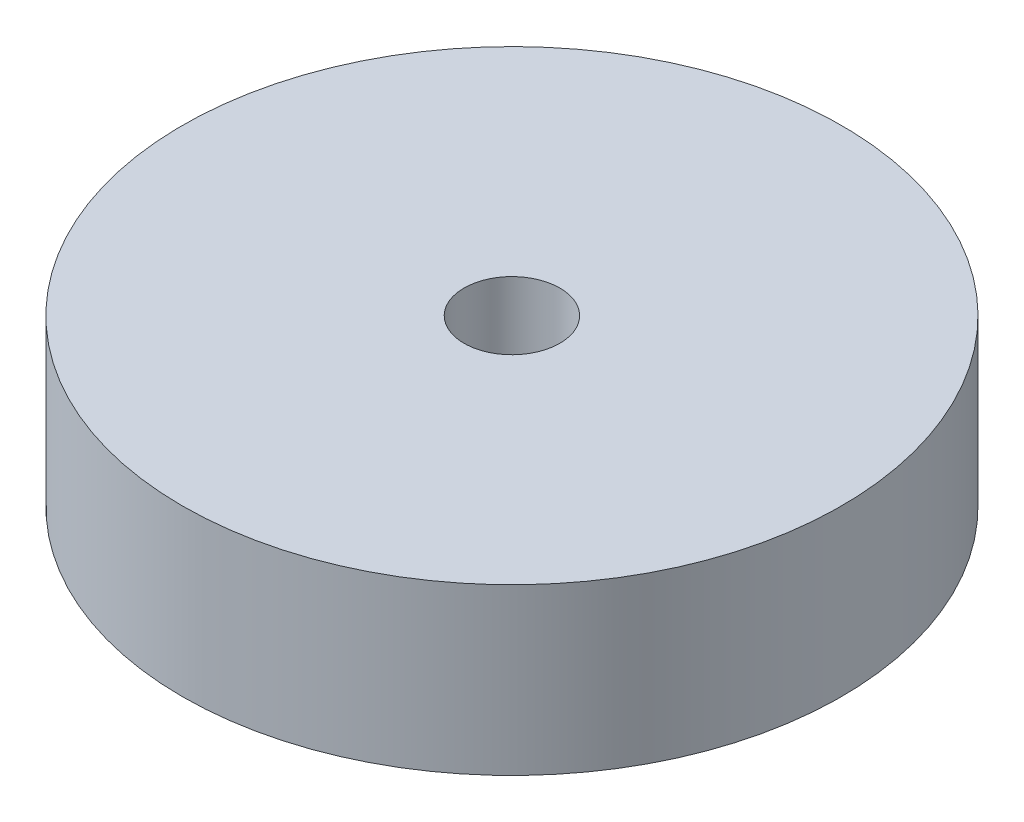
ISO-10303-21;
HEADER;
FILE_DESCRIPTION(('STEP AP214'),'2;1');
FILE_NAME('part.step','',(''),(''),'','','');
FILE_SCHEMA(('AUTOMOTIVE_DESIGN { 1 0 10303 214 1 1 1 1 }'));
ENDSEC;
DATA;
#1=APPLICATION_CONTEXT('core data for automotive mechanical design processes');
#2=APPLICATION_PROTOCOL_DEFINITION('international standard','automotive_design',2000,#1);
#3=PRODUCT_CONTEXT('',#1,'mechanical');
#4=PRODUCT('Part','Part','',(#3));
#5=PRODUCT_RELATED_PRODUCT_CATEGORY('part','',(#4));
#6=PRODUCT_DEFINITION_FORMATION('','',#4);
#7=PRODUCT_DEFINITION_CONTEXT('part definition',#1,'design');
#8=PRODUCT_DEFINITION('design','',#6,#7);
#9=PRODUCT_DEFINITION_SHAPE('','',#8);
#10=(LENGTH_UNIT() NAMED_UNIT(*) SI_UNIT(.MILLI.,.METRE.));
#11=(NAMED_UNIT(*) PLANE_ANGLE_UNIT() SI_UNIT($,.RADIAN.));
#12=(NAMED_UNIT(*) SI_UNIT($,.STERADIAN.) SOLID_ANGLE_UNIT());
#13=UNCERTAINTY_MEASURE_WITH_UNIT(LENGTH_MEASURE(1.E-05),#10,'distance_accuracy_value','');
#14=(GEOMETRIC_REPRESENTATION_CONTEXT(3) GLOBAL_UNCERTAINTY_ASSIGNED_CONTEXT((#13)) GLOBAL_UNIT_ASSIGNED_CONTEXT((#10,
#11,#12)) REPRESENTATION_CONTEXT('',''));
#15=CARTESIAN_POINT('',(0.,0.,0.));
#16=DIRECTION('',(0.,0.,1.));
#17=DIRECTION('',(1.,0.,0.));
#18=AXIS2_PLACEMENT_3D('',#15,#16,#17);
#19=CARTESIAN_POINT('',(0.,10.,0.));
#20=DIRECTION('',(0.,-1.,0.));
#21=DIRECTION('',(0.,0.,-1.));
#22=AXIS2_PLACEMENT_3D('',#19,#20,#21);
#23=CYLINDRICAL_SURFACE('',#22,19.95);
#24=CARTESIAN_POINT('',(0.,10.,0.));
#25=DIRECTION('',(0.,1.,0.));
#26=DIRECTION('',(0.,0.,1.));
#27=AXIS2_PLACEMENT_3D('',#24,#25,#26);
#28=CIRCLE('',#27,19.95);
#29=CARTESIAN_POINT('',(0.,10.,19.95));
#30=VERTEX_POINT('',#29);
#31=EDGE_CURVE('E10',#30,#30,#28,.T.);
#32=ORIENTED_EDGE('',*,*,#31,.F.);
#33=EDGE_LOOP('',(#32));
#34=FACE_BOUND('',#33,.T.);
#35=CARTESIAN_POINT('',(0.,0.,0.));
#36=DIRECTION('',(0.,1.,0.));
#37=DIRECTION('',(0.,0.,1.));
#38=AXIS2_PLACEMENT_3D('',#35,#36,#37);
#39=CIRCLE('',#38,19.95);
#40=CARTESIAN_POINT('',(0.,0.,19.95));
#41=VERTEX_POINT('',#40);
#42=EDGE_CURVE('E40',#41,#41,#39,.T.);
#43=ORIENTED_EDGE('',*,*,#42,.T.);
#44=EDGE_LOOP('',(#43));
#45=FACE_BOUND('',#44,.T.);
#46=ADVANCED_FACE('F37',(#34,#45),#23,.T.);
#47=CARTESIAN_POINT('',(0.,10.,0.));
#48=DIRECTION('',(0.,1.,0.));
#49=DIRECTION('',(0.,0.,1.));
#50=AXIS2_PLACEMENT_3D('',#47,#48,#49);
#51=PLANE('',#50);
#52=CARTESIAN_POINT('',(0.,10.,0.));
#53=DIRECTION('',(0.,-1.,0.));
#54=DIRECTION('',(0.,0.,-1.));
#55=AXIS2_PLACEMENT_3D('',#52,#53,#54);
#56=CIRCLE('',#55,2.9);
#57=CARTESIAN_POINT('',(0.,10.,-2.9));
#58=VERTEX_POINT('',#57);
#59=EDGE_CURVE('E55',#58,#58,#56,.T.);
#60=ORIENTED_EDGE('',*,*,#59,.T.);
#61=EDGE_LOOP('',(#60));
#62=FACE_BOUND('',#61,.T.);
#63=ORIENTED_EDGE('',*,*,#31,.T.);
#64=EDGE_LOOP('',(#63));
#65=FACE_BOUND('',#64,.T.);
#66=ADVANCED_FACE('F67',(#62,#65),#51,.T.);
#67=CARTESIAN_POINT('',(0.,0.,0.));
#68=DIRECTION('',(0.,1.,0.));
#69=DIRECTION('',(0.,0.,1.));
#70=AXIS2_PLACEMENT_3D('',#67,#68,#69);
#71=PLANE('',#70);
#72=CARTESIAN_POINT('',(0.,0.,0.));
#73=DIRECTION('',(0.,-1.,0.));
#74=DIRECTION('',(0.,0.,-1.));
#75=AXIS2_PLACEMENT_3D('',#72,#73,#74);
#76=CIRCLE('',#75,5.25);
#77=CARTESIAN_POINT('',(0.,0.,-5.25));
#78=VERTEX_POINT('',#77);
#79=EDGE_CURVE('E51',#78,#78,#76,.T.);
#80=ORIENTED_EDGE('',*,*,#79,.F.);
#81=EDGE_LOOP('',(#80));
#82=FACE_BOUND('',#81,.T.);
#83=ORIENTED_EDGE('',*,*,#42,.F.);
#84=EDGE_LOOP('',(#83));
#85=FACE_BOUND('',#84,.T.);
#86=ADVANCED_FACE('F84',(#82,#85),#71,.F.);
#87=CARTESIAN_POINT('',(0.,5.,0.));
#88=DIRECTION('',(0.,-1.,0.));
#89=DIRECTION('',(0.,0.,-1.));
#90=AXIS2_PLACEMENT_3D('',#87,#88,#89);
#91=CYLINDRICAL_SURFACE('',#90,5.25);
#92=CARTESIAN_POINT('',(0.,5.,0.));
#93=DIRECTION('',(0.,-1.,0.));
#94=DIRECTION('',(0.,0.,-1.));
#95=AXIS2_PLACEMENT_3D('',#92,#93,#94);
#96=CIRCLE('',#95,5.25);
#97=CARTESIAN_POINT('',(0.,5.,-5.25));
#98=VERTEX_POINT('',#97);
#99=EDGE_CURVE('E49',#98,#98,#96,.T.);
#100=ORIENTED_EDGE('',*,*,#99,.F.);
#101=EDGE_LOOP('',(#100));
#102=FACE_BOUND('',#101,.T.);
#103=ORIENTED_EDGE('',*,*,#79,.T.);
#104=EDGE_LOOP('',(#103));
#105=FACE_BOUND('',#104,.T.);
#106=ADVANCED_FACE('F78',(#102,#105),#91,.F.);
#107=CARTESIAN_POINT('',(0.,5.,0.));
#108=DIRECTION('',(0.,-1.,0.));
#109=DIRECTION('',(0.,0.,-1.));
#110=AXIS2_PLACEMENT_3D('',#107,#108,#109);
#111=PLANE('',#110);
#112=CARTESIAN_POINT('',(0.,5.,0.));
#113=DIRECTION('',(0.,-1.,0.));
#114=DIRECTION('',(0.,0.,-1.));
#115=AXIS2_PLACEMENT_3D('',#112,#113,#114);
#116=CIRCLE('',#115,2.9);
#117=CARTESIAN_POINT('',(0.,5.,-2.9));
#118=VERTEX_POINT('',#117);
#119=EDGE_CURVE('E59',#118,#118,#116,.T.);
#120=ORIENTED_EDGE('',*,*,#119,.F.);
#121=EDGE_LOOP('',(#120));
#122=FACE_BOUND('',#121,.T.);
#123=ORIENTED_EDGE('',*,*,#99,.T.);
#124=EDGE_LOOP('',(#123));
#125=FACE_BOUND('',#124,.T.);
#126=ADVANCED_FACE('F72',(#122,#125),#111,.T.);
#127=CARTESIAN_POINT('',(0.,10.,0.));
#128=DIRECTION('',(0.,-1.,0.));
#129=DIRECTION('',(0.,0.,-1.));
#130=AXIS2_PLACEMENT_3D('',#127,#128,#129);
#131=CYLINDRICAL_SURFACE('',#130,2.9);
#132=ORIENTED_EDGE('',*,*,#59,.F.);
#133=EDGE_LOOP('',(#132));
#134=FACE_BOUND('',#133,.T.);
#135=ORIENTED_EDGE('',*,*,#119,.T.);
#136=EDGE_LOOP('',(#135));
#137=FACE_BOUND('',#136,.T.);
#138=ADVANCED_FACE('F69',(#134,#137),#131,.F.);
#139=CLOSED_SHELL('',(#46,#66,#86,#106,#126,#138));
#140=MANIFOLD_SOLID_BREP('B2',#139);
#141=ADVANCED_BREP_SHAPE_REPRESENTATION('',(#18,#140),#14);
#142=SHAPE_DEFINITION_REPRESENTATION(#9,#141);
ENDSEC;
END-ISO-10303-21;
